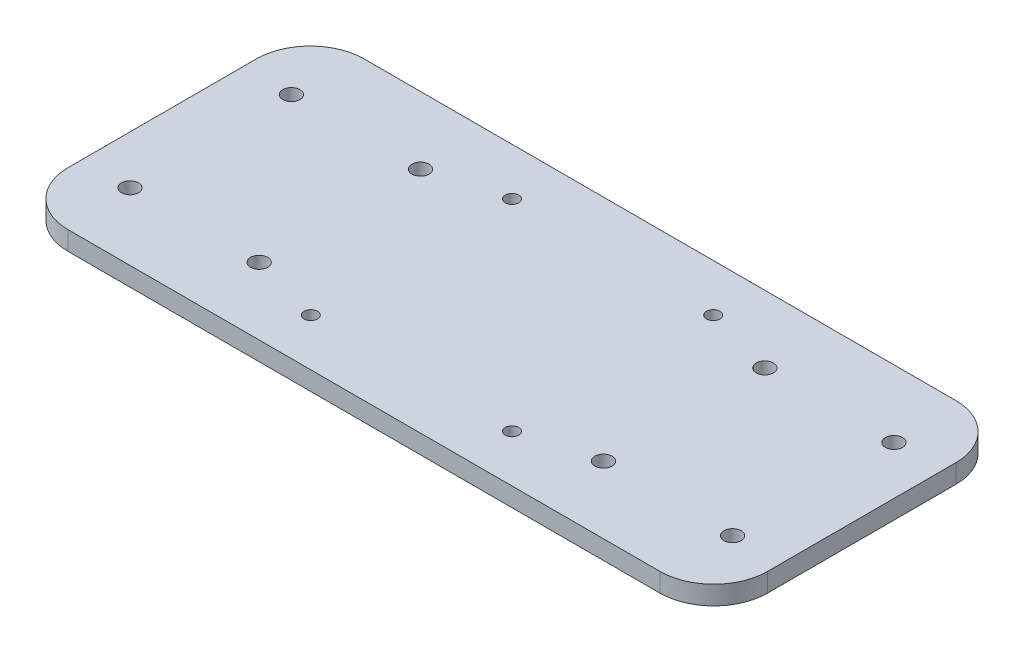
ISO-10303-21;
HEADER;
FILE_DESCRIPTION(('STEP AP214'),'2;1');
FILE_NAME('part.step','',(''),(''),'','','');
FILE_SCHEMA(('AUTOMOTIVE_DESIGN { 1 0 10303 214 1 1 1 1 }'));
ENDSEC;
DATA;
#1=APPLICATION_CONTEXT('core data for automotive mechanical design processes');
#2=APPLICATION_PROTOCOL_DEFINITION('international standard','automotive_design',2000,#1);
#3=PRODUCT_CONTEXT('',#1,'mechanical');
#4=PRODUCT('Part','Part','',(#3));
#5=PRODUCT_RELATED_PRODUCT_CATEGORY('part','',(#4));
#6=PRODUCT_DEFINITION_FORMATION('','',#4);
#7=PRODUCT_DEFINITION_CONTEXT('part definition',#1,'design');
#8=PRODUCT_DEFINITION('design','',#6,#7);
#9=PRODUCT_DEFINITION_SHAPE('','',#8);
#10=(LENGTH_UNIT() NAMED_UNIT(*) SI_UNIT(.MILLI.,.METRE.));
#11=(NAMED_UNIT(*) PLANE_ANGLE_UNIT() SI_UNIT($,.RADIAN.));
#12=(NAMED_UNIT(*) SI_UNIT($,.STERADIAN.) SOLID_ANGLE_UNIT());
#13=UNCERTAINTY_MEASURE_WITH_UNIT(LENGTH_MEASURE(1.E-05),#10,'distance_accuracy_value','');
#14=(GEOMETRIC_REPRESENTATION_CONTEXT(3) GLOBAL_UNCERTAINTY_ASSIGNED_CONTEXT((#13)) GLOBAL_UNIT_ASSIGNED_CONTEXT((#10,
#11,#12)) REPRESENTATION_CONTEXT('',''));
#15=CARTESIAN_POINT('',(0.,0.,0.));
#16=DIRECTION('',(0.,0.,1.));
#17=DIRECTION('',(1.,0.,0.));
#18=AXIS2_PLACEMENT_3D('',#15,#16,#17);
#19=CARTESIAN_POINT('',(0.,3.5,0.));
#20=DIRECTION('',(0.,1.,0.));
#21=DIRECTION('',(0.,0.,1.));
#22=AXIS2_PLACEMENT_3D('',#19,#20,#21);
#23=PLANE('',#22);
#24=CARTESIAN_POINT('',(46.3,3.5,46.2));
#25=DIRECTION('',(0.,1.,0.));
#26=DIRECTION('',(0.,0.,1.));
#27=AXIS2_PLACEMENT_3D('',#24,#25,#26);
#28=CIRCLE('',#27,1.25);
#29=CARTESIAN_POINT('',(46.3,3.5,47.45));
#30=VERTEX_POINT('',#29);
#31=EDGE_CURVE('E271',#30,#30,#28,.T.);
#32=ORIENTED_EDGE('',*,*,#31,.F.);
#33=EDGE_LOOP('',(#32));
#34=FACE_BOUND('',#33,.T.);
#35=CARTESIAN_POINT('',(83.7,3.5,8.8));
#36=DIRECTION('',(0.,1.,0.));
#37=DIRECTION('',(0.,0.,1.));
#38=AXIS2_PLACEMENT_3D('',#35,#36,#37);
#39=CIRCLE('',#38,1.25);
#40=CARTESIAN_POINT('',(83.7,3.5,10.05));
#41=VERTEX_POINT('',#40);
#42=EDGE_CURVE('E255',#41,#41,#39,.T.);
#43=ORIENTED_EDGE('',*,*,#42,.F.);
#44=EDGE_LOOP('',(#43));
#45=FACE_BOUND('',#44,.T.);
#46=CARTESIAN_POINT('',(97.,3.5,12.5));
#47=DIRECTION('',(0.,1.,0.));
#48=DIRECTION('',(0.,0.,-1.));
#49=AXIS2_PLACEMENT_3D('',#46,#47,#48);
#50=CIRCLE('',#49,1.6);
#51=CARTESIAN_POINT('',(97.,3.5,10.9));
#52=VERTEX_POINT('',#51);
#53=EDGE_CURVE('E239',#52,#52,#50,.T.);
#54=ORIENTED_EDGE('',*,*,#53,.F.);
#55=EDGE_LOOP('',(#54));
#56=FACE_BOUND('',#55,.T.);
#57=CARTESIAN_POINT('',(121.,3.5,42.5));
#58=DIRECTION('',(0.,1.,0.));
#59=DIRECTION('',(0.,0.,-1.));
#60=AXIS2_PLACEMENT_3D('',#57,#58,#59);
#61=CIRCLE('',#60,1.59999999999999);
#62=CARTESIAN_POINT('',(121.,3.5,40.9));
#63=VERTEX_POINT('',#62);
#64=EDGE_CURVE('E223',#63,#63,#61,.T.);
#65=ORIENTED_EDGE('',*,*,#64,.F.);
#66=EDGE_LOOP('',(#65));
#67=FACE_BOUND('',#66,.T.);
#68=CARTESIAN_POINT('',(33.,3.5,12.5));
#69=DIRECTION('',(0.,1.,0.));
#70=DIRECTION('',(0.,0.,1.));
#71=AXIS2_PLACEMENT_3D('',#68,#69,#70);
#72=CIRCLE('',#71,1.6);
#73=CARTESIAN_POINT('',(33.,3.5,14.1));
#74=VERTEX_POINT('',#73);
#75=EDGE_CURVE('E207',#74,#74,#72,.T.);
#76=ORIENTED_EDGE('',*,*,#75,.F.);
#77=EDGE_LOOP('',(#76));
#78=FACE_BOUND('',#77,.T.);
#79=CARTESIAN_POINT('',(9.,3.5,12.5));
#80=DIRECTION('',(0.,1.,0.));
#81=DIRECTION('',(0.,0.,1.));
#82=AXIS2_PLACEMENT_3D('',#79,#80,#81);
#83=CIRCLE('',#82,1.6);
#84=CARTESIAN_POINT('',(9.,3.5,14.1));
#85=VERTEX_POINT('',#84);
#86=EDGE_CURVE('E144',#85,#85,#83,.T.);
#87=ORIENTED_EDGE('',*,*,#86,.F.);
#88=EDGE_LOOP('',(#87));
#89=FACE_BOUND('',#88,.T.);
#90=DIRECTION('',(0.,0.,1.));
#91=VECTOR('',#90,1.);
#92=CARTESIAN_POINT('',(0.,3.5,0.));
#93=LINE('',#92,#91);
#94=CARTESIAN_POINT('',(0.,3.5,10.));
#95=VERTEX_POINT('',#94);
#96=CARTESIAN_POINT('',(0.,3.5,45.));
#97=VERTEX_POINT('',#96);
#98=EDGE_CURVE('E150',#95,#97,#93,.T.);
#99=ORIENTED_EDGE('',*,*,#98,.T.);
#100=CARTESIAN_POINT('',(10.,3.5,45.));
#101=DIRECTION('',(0.,1.,0.));
#102=DIRECTION('',(0.,0.,1.));
#103=AXIS2_PLACEMENT_3D('',#100,#101,#102);
#104=CIRCLE('',#103,10.);
#105=CARTESIAN_POINT('',(10.,3.5,55.));
#106=VERTEX_POINT('',#105);
#107=EDGE_CURVE('E174',#97,#106,#104,.T.);
#108=ORIENTED_EDGE('',*,*,#107,.T.);
#109=DIRECTION('',(1.,0.,0.));
#110=VECTOR('',#109,1.);
#111=CARTESIAN_POINT('',(0.,3.5,55.));
#112=LINE('',#111,#110);
#113=CARTESIAN_POINT('',(120.,3.5,55.));
#114=VERTEX_POINT('',#113);
#115=EDGE_CURVE('E127',#106,#114,#112,.T.);
#116=ORIENTED_EDGE('',*,*,#115,.T.);
#117=CARTESIAN_POINT('',(120.,3.5,45.));
#118=DIRECTION('',(0.,1.,0.));
#119=DIRECTION('',(0.,0.,1.));
#120=AXIS2_PLACEMENT_3D('',#117,#118,#119);
#121=CIRCLE('',#120,10.);
#122=CARTESIAN_POINT('',(130.,3.5,45.));
#123=VERTEX_POINT('',#122);
#124=EDGE_CURVE('E171',#114,#123,#121,.T.);
#125=ORIENTED_EDGE('',*,*,#124,.T.);
#126=DIRECTION('',(0.,0.,-1.));
#127=VECTOR('',#126,1.);
#128=CARTESIAN_POINT('',(130.,3.5,0.));
#129=LINE('',#128,#127);
#130=CARTESIAN_POINT('',(130.,3.5,10.));
#131=VERTEX_POINT('',#130);
#132=EDGE_CURVE('E186',#123,#131,#129,.T.);
#133=ORIENTED_EDGE('',*,*,#132,.T.);
#134=CARTESIAN_POINT('',(120.,3.5,10.));
#135=DIRECTION('',(0.,1.,0.));
#136=DIRECTION('',(0.,0.,1.));
#137=AXIS2_PLACEMENT_3D('',#134,#135,#136);
#138=CIRCLE('',#137,10.);
#139=CARTESIAN_POINT('',(120.,3.5,0.));
#140=VERTEX_POINT('',#139);
#141=EDGE_CURVE('E61',#131,#140,#138,.T.);
#142=ORIENTED_EDGE('',*,*,#141,.T.);
#143=DIRECTION('',(-1.,0.,0.));
#144=VECTOR('',#143,1.);
#145=CARTESIAN_POINT('',(0.,3.5,0.));
#146=LINE('',#145,#144);
#147=CARTESIAN_POINT('',(10.,3.5,0.));
#148=VERTEX_POINT('',#147);
#149=EDGE_CURVE('E152',#140,#148,#146,.T.);
#150=ORIENTED_EDGE('',*,*,#149,.T.);
#151=CARTESIAN_POINT('',(10.,3.5,10.));
#152=DIRECTION('',(0.,1.,0.));
#153=DIRECTION('',(0.,0.,1.));
#154=AXIS2_PLACEMENT_3D('',#151,#152,#153);
#155=CIRCLE('',#154,10.);
#156=EDGE_CURVE('E166',#148,#95,#155,.T.);
#157=ORIENTED_EDGE('',*,*,#156,.T.);
#158=EDGE_LOOP('',(#99,#108,#116,#125,#133,#142,#150,#157));
#159=FACE_BOUND('',#158,.T.);
#160=CARTESIAN_POINT('',(9.00000000000007,3.5,42.5));
#161=DIRECTION('',(0.,1.,0.));
#162=DIRECTION('',(0.,0.,1.));
#163=AXIS2_PLACEMENT_3D('',#160,#161,#162);
#164=CIRCLE('',#163,1.59999999999993);
#165=CARTESIAN_POINT('',(9.00000000000007,3.5,44.0999999999999));
#166=VERTEX_POINT('',#165);
#167=EDGE_CURVE('E199',#166,#166,#164,.T.);
#168=ORIENTED_EDGE('',*,*,#167,.F.);
#169=EDGE_LOOP('',(#168));
#170=FACE_BOUND('',#169,.T.);
#171=CARTESIAN_POINT('',(33.0000000000001,3.5,42.5));
#172=DIRECTION('',(0.,1.,0.));
#173=DIRECTION('',(0.,0.,1.));
#174=AXIS2_PLACEMENT_3D('',#171,#172,#173);
#175=CIRCLE('',#174,1.59999999999993);
#176=CARTESIAN_POINT('',(33.0000000000001,3.5,44.0999999999999));
#177=VERTEX_POINT('',#176);
#178=EDGE_CURVE('E215',#177,#177,#175,.T.);
#179=ORIENTED_EDGE('',*,*,#178,.F.);
#180=EDGE_LOOP('',(#179));
#181=FACE_BOUND('',#180,.T.);
#182=CARTESIAN_POINT('',(97.,3.5,42.5));
#183=DIRECTION('',(0.,1.,0.));
#184=DIRECTION('',(0.,0.,-1.));
#185=AXIS2_PLACEMENT_3D('',#182,#183,#184);
#186=CIRCLE('',#185,1.59999999999999);
#187=CARTESIAN_POINT('',(97.,3.5,40.9));
#188=VERTEX_POINT('',#187);
#189=EDGE_CURVE('E231',#188,#188,#186,.T.);
#190=ORIENTED_EDGE('',*,*,#189,.F.);
#191=EDGE_LOOP('',(#190));
#192=FACE_BOUND('',#191,.T.);
#193=CARTESIAN_POINT('',(121.,3.5,12.5));
#194=DIRECTION('',(0.,1.,0.));
#195=DIRECTION('',(0.,0.,-1.));
#196=AXIS2_PLACEMENT_3D('',#193,#194,#195);
#197=CIRCLE('',#196,1.59999999999999);
#198=CARTESIAN_POINT('',(121.,3.5,10.9));
#199=VERTEX_POINT('',#198);
#200=EDGE_CURVE('E247',#199,#199,#197,.T.);
#201=ORIENTED_EDGE('',*,*,#200,.F.);
#202=EDGE_LOOP('',(#201));
#203=FACE_BOUND('',#202,.T.);
#204=CARTESIAN_POINT('',(83.7,3.5,46.2));
#205=DIRECTION('',(0.,1.,0.));
#206=DIRECTION('',(0.,0.,1.));
#207=AXIS2_PLACEMENT_3D('',#204,#205,#206);
#208=CIRCLE('',#207,1.25);
#209=CARTESIAN_POINT('',(83.7,3.5,47.45));
#210=VERTEX_POINT('',#209);
#211=EDGE_CURVE('E263',#210,#210,#208,.T.);
#212=ORIENTED_EDGE('',*,*,#211,.F.);
#213=EDGE_LOOP('',(#212));
#214=FACE_BOUND('',#213,.T.);
#215=CARTESIAN_POINT('',(46.3,3.5,8.8));
#216=DIRECTION('',(0.,1.,0.));
#217=DIRECTION('',(0.,0.,1.));
#218=AXIS2_PLACEMENT_3D('',#215,#216,#217);
#219=CIRCLE('',#218,1.25);
#220=CARTESIAN_POINT('',(46.3,3.5,10.05));
#221=VERTEX_POINT('',#220);
#222=EDGE_CURVE('E279',#221,#221,#219,.T.);
#223=ORIENTED_EDGE('',*,*,#222,.F.);
#224=EDGE_LOOP('',(#223));
#225=FACE_BOUND('',#224,.T.);
#226=ADVANCED_FACE('F39',(#34,#45,#56,#67,#78,#89,#159,#170,#181,#192,#203,#214,#225),#23,.T.);
#227=CARTESIAN_POINT('',(0.,0.,0.));
#228=DIRECTION('',(0.,1.,0.));
#229=DIRECTION('',(0.,0.,1.));
#230=AXIS2_PLACEMENT_3D('',#227,#228,#229);
#231=PLANE('',#230);
#232=DIRECTION('',(1.,0.,0.));
#233=VECTOR('',#232,1.);
#234=CARTESIAN_POINT('',(0.,0.,55.));
#235=LINE('',#234,#233);
#236=CARTESIAN_POINT('',(10.,0.,55.));
#237=VERTEX_POINT('',#236);
#238=CARTESIAN_POINT('',(120.,0.,55.));
#239=VERTEX_POINT('',#238);
#240=EDGE_CURVE('E124',#237,#239,#235,.T.);
#241=ORIENTED_EDGE('',*,*,#240,.F.);
#242=CARTESIAN_POINT('',(10.,0.,45.));
#243=DIRECTION('',(0.,1.,0.));
#244=DIRECTION('',(0.,0.,1.));
#245=AXIS2_PLACEMENT_3D('',#242,#243,#244);
#246=CIRCLE('',#245,10.);
#247=CARTESIAN_POINT('',(0.,0.,45.));
#248=VERTEX_POINT('',#247);
#249=EDGE_CURVE('E106',#237,#248,#246,.F.);
#250=ORIENTED_EDGE('',*,*,#249,.T.);
#251=DIRECTION('',(0.,0.,1.));
#252=VECTOR('',#251,1.);
#253=CARTESIAN_POINT('',(0.,0.,0.));
#254=LINE('',#253,#252);
#255=CARTESIAN_POINT('',(0.,0.,10.));
#256=VERTEX_POINT('',#255);
#257=EDGE_CURVE('E137',#256,#248,#254,.T.);
#258=ORIENTED_EDGE('',*,*,#257,.F.);
#259=CARTESIAN_POINT('',(10.,0.,10.));
#260=DIRECTION('',(0.,1.,0.));
#261=DIRECTION('',(0.,0.,1.));
#262=AXIS2_PLACEMENT_3D('',#259,#260,#261);
#263=CIRCLE('',#262,10.);
#264=CARTESIAN_POINT('',(10.,0.,0.));
#265=VERTEX_POINT('',#264);
#266=EDGE_CURVE('E129',#256,#265,#263,.F.);
#267=ORIENTED_EDGE('',*,*,#266,.T.);
#268=DIRECTION('',(-1.,0.,0.));
#269=VECTOR('',#268,1.);
#270=CARTESIAN_POINT('',(0.,0.,0.));
#271=LINE('',#270,#269);
#272=CARTESIAN_POINT('',(120.,0.,0.));
#273=VERTEX_POINT('',#272);
#274=EDGE_CURVE('E142',#273,#265,#271,.T.);
#275=ORIENTED_EDGE('',*,*,#274,.F.);
#276=CARTESIAN_POINT('',(120.,0.,10.));
#277=DIRECTION('',(0.,1.,0.));
#278=DIRECTION('',(0.,0.,1.));
#279=AXIS2_PLACEMENT_3D('',#276,#277,#278);
#280=CIRCLE('',#279,10.);
#281=CARTESIAN_POINT('',(130.,0.,10.));
#282=VERTEX_POINT('',#281);
#283=EDGE_CURVE('E156',#273,#282,#280,.F.);
#284=ORIENTED_EDGE('',*,*,#283,.T.);
#285=DIRECTION('',(0.,0.,-1.));
#286=VECTOR('',#285,1.);
#287=CARTESIAN_POINT('',(130.,0.,0.));
#288=LINE('',#287,#286);
#289=CARTESIAN_POINT('',(130.,0.,45.));
#290=VERTEX_POINT('',#289);
#291=EDGE_CURVE('E136',#290,#282,#288,.T.);
#292=ORIENTED_EDGE('',*,*,#291,.F.);
#293=CARTESIAN_POINT('',(120.,0.,45.));
#294=DIRECTION('',(0.,1.,0.));
#295=DIRECTION('',(0.,0.,1.));
#296=AXIS2_PLACEMENT_3D('',#293,#294,#295);
#297=CIRCLE('',#296,10.);
#298=EDGE_CURVE('E118',#290,#239,#297,.F.);
#299=ORIENTED_EDGE('',*,*,#298,.T.);
#300=EDGE_LOOP('',(#241,#250,#258,#267,#275,#284,#292,#299));
#301=FACE_BOUND('',#300,.T.);
#302=CARTESIAN_POINT('',(9.,0.,12.5));
#303=DIRECTION('',(0.,1.,0.));
#304=DIRECTION('',(0.,0.,1.));
#305=AXIS2_PLACEMENT_3D('',#302,#303,#304);
#306=CIRCLE('',#305,1.6);
#307=CARTESIAN_POINT('',(9.,0.,14.1));
#308=VERTEX_POINT('',#307);
#309=EDGE_CURVE('E195',#308,#308,#306,.T.);
#310=ORIENTED_EDGE('',*,*,#309,.T.);
#311=EDGE_LOOP('',(#310));
#312=FACE_BOUND('',#311,.T.);
#313=CARTESIAN_POINT('',(9.00000000000007,0.,42.5));
#314=DIRECTION('',(0.,1.,0.));
#315=DIRECTION('',(0.,0.,1.));
#316=AXIS2_PLACEMENT_3D('',#313,#314,#315);
#317=CIRCLE('',#316,1.59999999999993);
#318=CARTESIAN_POINT('',(9.00000000000007,0.,44.0999999999999));
#319=VERTEX_POINT('',#318);
#320=EDGE_CURVE('E203',#319,#319,#317,.T.);
#321=ORIENTED_EDGE('',*,*,#320,.T.);
#322=EDGE_LOOP('',(#321));
#323=FACE_BOUND('',#322,.T.);
#324=CARTESIAN_POINT('',(33.,0.,12.5));
#325=DIRECTION('',(0.,1.,0.));
#326=DIRECTION('',(0.,0.,1.));
#327=AXIS2_PLACEMENT_3D('',#324,#325,#326);
#328=CIRCLE('',#327,1.6);
#329=CARTESIAN_POINT('',(33.,0.,14.1));
#330=VERTEX_POINT('',#329);
#331=EDGE_CURVE('E211',#330,#330,#328,.T.);
#332=ORIENTED_EDGE('',*,*,#331,.T.);
#333=EDGE_LOOP('',(#332));
#334=FACE_BOUND('',#333,.T.);
#335=CARTESIAN_POINT('',(33.0000000000001,0.,42.5));
#336=DIRECTION('',(0.,1.,0.));
#337=DIRECTION('',(0.,0.,1.));
#338=AXIS2_PLACEMENT_3D('',#335,#336,#337);
#339=CIRCLE('',#338,1.59999999999993);
#340=CARTESIAN_POINT('',(33.0000000000001,0.,44.0999999999999));
#341=VERTEX_POINT('',#340);
#342=EDGE_CURVE('E219',#341,#341,#339,.T.);
#343=ORIENTED_EDGE('',*,*,#342,.T.);
#344=EDGE_LOOP('',(#343));
#345=FACE_BOUND('',#344,.T.);
#346=CARTESIAN_POINT('',(121.,0.,42.5));
#347=DIRECTION('',(0.,1.,0.));
#348=DIRECTION('',(0.,0.,-1.));
#349=AXIS2_PLACEMENT_3D('',#346,#347,#348);
#350=CIRCLE('',#349,1.59999999999999);
#351=CARTESIAN_POINT('',(121.,0.,40.9));
#352=VERTEX_POINT('',#351);
#353=EDGE_CURVE('E227',#352,#352,#350,.T.);
#354=ORIENTED_EDGE('',*,*,#353,.T.);
#355=EDGE_LOOP('',(#354));
#356=FACE_BOUND('',#355,.T.);
#357=CARTESIAN_POINT('',(97.,0.,42.5));
#358=DIRECTION('',(0.,1.,0.));
#359=DIRECTION('',(0.,0.,-1.));
#360=AXIS2_PLACEMENT_3D('',#357,#358,#359);
#361=CIRCLE('',#360,1.59999999999999);
#362=CARTESIAN_POINT('',(97.,0.,40.9));
#363=VERTEX_POINT('',#362);
#364=EDGE_CURVE('E235',#363,#363,#361,.T.);
#365=ORIENTED_EDGE('',*,*,#364,.T.);
#366=EDGE_LOOP('',(#365));
#367=FACE_BOUND('',#366,.T.);
#368=CARTESIAN_POINT('',(97.,0.,12.5));
#369=DIRECTION('',(0.,1.,0.));
#370=DIRECTION('',(0.,0.,-1.));
#371=AXIS2_PLACEMENT_3D('',#368,#369,#370);
#372=CIRCLE('',#371,1.6);
#373=CARTESIAN_POINT('',(97.,0.,10.9));
#374=VERTEX_POINT('',#373);
#375=EDGE_CURVE('E243',#374,#374,#372,.T.);
#376=ORIENTED_EDGE('',*,*,#375,.T.);
#377=EDGE_LOOP('',(#376));
#378=FACE_BOUND('',#377,.T.);
#379=CARTESIAN_POINT('',(121.,0.,12.5));
#380=DIRECTION('',(0.,1.,0.));
#381=DIRECTION('',(0.,0.,-1.));
#382=AXIS2_PLACEMENT_3D('',#379,#380,#381);
#383=CIRCLE('',#382,1.59999999999999);
#384=CARTESIAN_POINT('',(121.,0.,10.9));
#385=VERTEX_POINT('',#384);
#386=EDGE_CURVE('E251',#385,#385,#383,.T.);
#387=ORIENTED_EDGE('',*,*,#386,.T.);
#388=EDGE_LOOP('',(#387));
#389=FACE_BOUND('',#388,.T.);
#390=CARTESIAN_POINT('',(83.7,0.,8.8));
#391=DIRECTION('',(0.,1.,0.));
#392=DIRECTION('',(0.,0.,1.));
#393=AXIS2_PLACEMENT_3D('',#390,#391,#392);
#394=CIRCLE('',#393,1.25);
#395=CARTESIAN_POINT('',(83.7,0.,10.05));
#396=VERTEX_POINT('',#395);
#397=EDGE_CURVE('E259',#396,#396,#394,.T.);
#398=ORIENTED_EDGE('',*,*,#397,.T.);
#399=EDGE_LOOP('',(#398));
#400=FACE_BOUND('',#399,.T.);
#401=CARTESIAN_POINT('',(83.7,0.,46.2));
#402=DIRECTION('',(0.,1.,0.));
#403=DIRECTION('',(0.,0.,1.));
#404=AXIS2_PLACEMENT_3D('',#401,#402,#403);
#405=CIRCLE('',#404,1.25);
#406=CARTESIAN_POINT('',(83.7,0.,47.45));
#407=VERTEX_POINT('',#406);
#408=EDGE_CURVE('E267',#407,#407,#405,.T.);
#409=ORIENTED_EDGE('',*,*,#408,.T.);
#410=EDGE_LOOP('',(#409));
#411=FACE_BOUND('',#410,.T.);
#412=CARTESIAN_POINT('',(46.3,0.,46.2));
#413=DIRECTION('',(0.,1.,0.));
#414=DIRECTION('',(0.,0.,1.));
#415=AXIS2_PLACEMENT_3D('',#412,#413,#414);
#416=CIRCLE('',#415,1.25);
#417=CARTESIAN_POINT('',(46.3,0.,47.45));
#418=VERTEX_POINT('',#417);
#419=EDGE_CURVE('E275',#418,#418,#416,.T.);
#420=ORIENTED_EDGE('',*,*,#419,.T.);
#421=EDGE_LOOP('',(#420));
#422=FACE_BOUND('',#421,.T.);
#423=CARTESIAN_POINT('',(46.3,0.,8.8));
#424=DIRECTION('',(0.,1.,0.));
#425=DIRECTION('',(0.,0.,1.));
#426=AXIS2_PLACEMENT_3D('',#423,#424,#425);
#427=CIRCLE('',#426,1.25);
#428=CARTESIAN_POINT('',(46.3,0.,10.05));
#429=VERTEX_POINT('',#428);
#430=EDGE_CURVE('E283',#429,#429,#427,.T.);
#431=ORIENTED_EDGE('',*,*,#430,.T.);
#432=EDGE_LOOP('',(#431));
#433=FACE_BOUND('',#432,.T.);
#434=ADVANCED_FACE('F132',(#301,#312,#323,#334,#345,#356,#367,#378,#389,#400,#411,#422,#433),
#231,.F.);
#435=CARTESIAN_POINT('',(0.,3.5,0.));
#436=DIRECTION('',(1.,0.,0.));
#437=DIRECTION('',(0.,0.,-1.));
#438=AXIS2_PLACEMENT_3D('',#435,#436,#437);
#439=PLANE('',#438);
#440=ORIENTED_EDGE('',*,*,#257,.T.);
#441=DIRECTION('',(0.,-1.,0.));
#442=VECTOR('',#441,1.);
#443=CARTESIAN_POINT('',(0.,3.5,45.));
#444=LINE('',#443,#442);
#445=EDGE_CURVE('E111',#248,#97,#444,.F.);
#446=ORIENTED_EDGE('',*,*,#445,.T.);
#447=ORIENTED_EDGE('',*,*,#98,.F.);
#448=DIRECTION('',(0.,-1.,0.));
#449=VECTOR('',#448,1.);
#450=CARTESIAN_POINT('',(0.,3.5,10.));
#451=LINE('',#450,#449);
#452=EDGE_CURVE('E117',#95,#256,#451,.T.);
#453=ORIENTED_EDGE('',*,*,#452,.T.);
#454=EDGE_LOOP('',(#440,#446,#447,#453));
#455=FACE_BOUND('',#454,.T.);
#456=ADVANCED_FACE('F300',(#455),#439,.F.);
#457=CARTESIAN_POINT('',(0.,3.5,55.));
#458=DIRECTION('',(0.,0.,-1.));
#459=DIRECTION('',(-1.,0.,0.));
#460=AXIS2_PLACEMENT_3D('',#457,#458,#459);
#461=PLANE('',#460);
#462=ORIENTED_EDGE('',*,*,#115,.F.);
#463=DIRECTION('',(0.,-1.,0.));
#464=VECTOR('',#463,1.);
#465=CARTESIAN_POINT('',(10.,3.5,55.));
#466=LINE('',#465,#464);
#467=EDGE_CURVE('E110',#106,#237,#466,.T.);
#468=ORIENTED_EDGE('',*,*,#467,.T.);
#469=ORIENTED_EDGE('',*,*,#240,.T.);
#470=DIRECTION('',(0.,-1.,0.));
#471=VECTOR('',#470,1.);
#472=CARTESIAN_POINT('',(120.,3.5,55.));
#473=LINE('',#472,#471);
#474=EDGE_CURVE('E130',#239,#114,#473,.F.);
#475=ORIENTED_EDGE('',*,*,#474,.T.);
#476=EDGE_LOOP('',(#462,#468,#469,#475));
#477=FACE_BOUND('',#476,.T.);
#478=ADVANCED_FACE('F123',(#477),#461,.F.);
#479=CARTESIAN_POINT('',(130.,3.5,0.));
#480=DIRECTION('',(-1.,0.,0.));
#481=DIRECTION('',(0.,0.,1.));
#482=AXIS2_PLACEMENT_3D('',#479,#480,#481);
#483=PLANE('',#482);
#484=ORIENTED_EDGE('',*,*,#132,.F.);
#485=DIRECTION('',(0.,-1.,0.));
#486=VECTOR('',#485,1.);
#487=CARTESIAN_POINT('',(130.,3.5,45.));
#488=LINE('',#487,#486);
#489=EDGE_CURVE('E180',#123,#290,#488,.T.);
#490=ORIENTED_EDGE('',*,*,#489,.T.);
#491=ORIENTED_EDGE('',*,*,#291,.T.);
#492=DIRECTION('',(0.,-1.,0.));
#493=VECTOR('',#492,1.);
#494=CARTESIAN_POINT('',(130.,3.5,10.));
#495=LINE('',#494,#493);
#496=EDGE_CURVE('E177',#282,#131,#495,.F.);
#497=ORIENTED_EDGE('',*,*,#496,.T.);
#498=EDGE_LOOP('',(#484,#490,#491,#497));
#499=FACE_BOUND('',#498,.T.);
#500=ADVANCED_FACE('F311',(#499),#483,.F.);
#501=CARTESIAN_POINT('',(0.,3.5,0.));
#502=DIRECTION('',(0.,0.,1.));
#503=DIRECTION('',(1.,0.,0.));
#504=AXIS2_PLACEMENT_3D('',#501,#502,#503);
#505=PLANE('',#504);
#506=ORIENTED_EDGE('',*,*,#149,.F.);
#507=DIRECTION('',(0.,-1.,0.));
#508=VECTOR('',#507,1.);
#509=CARTESIAN_POINT('',(120.,3.5,0.));
#510=LINE('',#509,#508);
#511=EDGE_CURVE('E11',#140,#273,#510,.T.);
#512=ORIENTED_EDGE('',*,*,#511,.T.);
#513=ORIENTED_EDGE('',*,*,#274,.T.);
#514=DIRECTION('',(0.,-1.,0.));
#515=VECTOR('',#514,1.);
#516=CARTESIAN_POINT('',(10.,3.5,0.));
#517=LINE('',#516,#515);
#518=EDGE_CURVE('E48',#265,#148,#517,.F.);
#519=ORIENTED_EDGE('',*,*,#518,.T.);
#520=EDGE_LOOP('',(#506,#512,#513,#519));
#521=FACE_BOUND('',#520,.T.);
#522=ADVANCED_FACE('F308',(#521),#505,.F.);
#523=CARTESIAN_POINT('',(9.,3.5,12.5));
#524=DIRECTION('',(0.,-1.,0.));
#525=DIRECTION('',(0.,0.,-1.));
#526=AXIS2_PLACEMENT_3D('',#523,#524,#525);
#527=CYLINDRICAL_SURFACE('',#526,1.6);
#528=ORIENTED_EDGE('',*,*,#86,.T.);
#529=EDGE_LOOP('',(#528));
#530=FACE_BOUND('',#529,.T.);
#531=ORIENTED_EDGE('',*,*,#309,.F.);
#532=EDGE_LOOP('',(#531));
#533=FACE_BOUND('',#532,.T.);
#534=ADVANCED_FACE('F305',(#530,#533),#527,.F.);
#535=CARTESIAN_POINT('',(9.00000000000007,3.5,42.5));
#536=DIRECTION('',(0.,-1.,0.));
#537=DIRECTION('',(0.,0.,-1.));
#538=AXIS2_PLACEMENT_3D('',#535,#536,#537);
#539=CYLINDRICAL_SURFACE('',#538,1.59999999999993);
#540=ORIENTED_EDGE('',*,*,#167,.T.);
#541=EDGE_LOOP('',(#540));
#542=FACE_BOUND('',#541,.T.);
#543=ORIENTED_EDGE('',*,*,#320,.F.);
#544=EDGE_LOOP('',(#543));
#545=FACE_BOUND('',#544,.T.);
#546=ADVANCED_FACE('F393',(#542,#545),#539,.F.);
#547=CARTESIAN_POINT('',(33.,3.5,12.5));
#548=DIRECTION('',(0.,-1.,0.));
#549=DIRECTION('',(0.,0.,-1.));
#550=AXIS2_PLACEMENT_3D('',#547,#548,#549);
#551=CYLINDRICAL_SURFACE('',#550,1.6);
#552=ORIENTED_EDGE('',*,*,#75,.T.);
#553=EDGE_LOOP('',(#552));
#554=FACE_BOUND('',#553,.T.);
#555=ORIENTED_EDGE('',*,*,#331,.F.);
#556=EDGE_LOOP('',(#555));
#557=FACE_BOUND('',#556,.T.);
#558=ADVANCED_FACE('F390',(#554,#557),#551,.F.);
#559=CARTESIAN_POINT('',(33.0000000000001,3.5,42.5));
#560=DIRECTION('',(0.,-1.,0.));
#561=DIRECTION('',(0.,0.,-1.));
#562=AXIS2_PLACEMENT_3D('',#559,#560,#561);
#563=CYLINDRICAL_SURFACE('',#562,1.59999999999993);
#564=ORIENTED_EDGE('',*,*,#178,.T.);
#565=EDGE_LOOP('',(#564));
#566=FACE_BOUND('',#565,.T.);
#567=ORIENTED_EDGE('',*,*,#342,.F.);
#568=EDGE_LOOP('',(#567));
#569=FACE_BOUND('',#568,.T.);
#570=ADVANCED_FACE('F386',(#566,#569),#563,.F.);
#571=CARTESIAN_POINT('',(121.,3.5,42.5));
#572=DIRECTION('',(0.,-1.,0.));
#573=DIRECTION('',(0.,0.,-1.));
#574=AXIS2_PLACEMENT_3D('',#571,#572,#573);
#575=CYLINDRICAL_SURFACE('',#574,1.59999999999999);
#576=ORIENTED_EDGE('',*,*,#64,.T.);
#577=EDGE_LOOP('',(#576));
#578=FACE_BOUND('',#577,.T.);
#579=ORIENTED_EDGE('',*,*,#353,.F.);
#580=EDGE_LOOP('',(#579));
#581=FACE_BOUND('',#580,.T.);
#582=ADVANCED_FACE('F382',(#578,#581),#575,.F.);
#583=CARTESIAN_POINT('',(97.,3.5,42.5));
#584=DIRECTION('',(0.,-1.,0.));
#585=DIRECTION('',(0.,0.,-1.));
#586=AXIS2_PLACEMENT_3D('',#583,#584,#585);
#587=CYLINDRICAL_SURFACE('',#586,1.59999999999999);
#588=ORIENTED_EDGE('',*,*,#189,.T.);
#589=EDGE_LOOP('',(#588));
#590=FACE_BOUND('',#589,.T.);
#591=ORIENTED_EDGE('',*,*,#364,.F.);
#592=EDGE_LOOP('',(#591));
#593=FACE_BOUND('',#592,.T.);
#594=ADVANCED_FACE('F378',(#590,#593),#587,.F.);
#595=CARTESIAN_POINT('',(97.,3.5,12.5));
#596=DIRECTION('',(0.,-1.,0.));
#597=DIRECTION('',(0.,0.,-1.));
#598=AXIS2_PLACEMENT_3D('',#595,#596,#597);
#599=CYLINDRICAL_SURFACE('',#598,1.6);
#600=ORIENTED_EDGE('',*,*,#53,.T.);
#601=EDGE_LOOP('',(#600));
#602=FACE_BOUND('',#601,.T.);
#603=ORIENTED_EDGE('',*,*,#375,.F.);
#604=EDGE_LOOP('',(#603));
#605=FACE_BOUND('',#604,.T.);
#606=ADVANCED_FACE('F374',(#602,#605),#599,.F.);
#607=CARTESIAN_POINT('',(121.,3.5,12.5));
#608=DIRECTION('',(0.,-1.,0.));
#609=DIRECTION('',(0.,0.,-1.));
#610=AXIS2_PLACEMENT_3D('',#607,#608,#609);
#611=CYLINDRICAL_SURFACE('',#610,1.59999999999999);
#612=ORIENTED_EDGE('',*,*,#200,.T.);
#613=EDGE_LOOP('',(#612));
#614=FACE_BOUND('',#613,.T.);
#615=ORIENTED_EDGE('',*,*,#386,.F.);
#616=EDGE_LOOP('',(#615));
#617=FACE_BOUND('',#616,.T.);
#618=ADVANCED_FACE('F370',(#614,#617),#611,.F.);
#619=CARTESIAN_POINT('',(83.7,3.5,8.8));
#620=DIRECTION('',(0.,-1.,0.));
#621=DIRECTION('',(0.,0.,-1.));
#622=AXIS2_PLACEMENT_3D('',#619,#620,#621);
#623=CYLINDRICAL_SURFACE('',#622,1.25);
#624=ORIENTED_EDGE('',*,*,#42,.T.);
#625=EDGE_LOOP('',(#624));
#626=FACE_BOUND('',#625,.T.);
#627=ORIENTED_EDGE('',*,*,#397,.F.);
#628=EDGE_LOOP('',(#627));
#629=FACE_BOUND('',#628,.T.);
#630=ADVANCED_FACE('F352',(#626,#629),#623,.F.);
#631=CARTESIAN_POINT('',(83.7,3.5,46.2));
#632=DIRECTION('',(0.,-1.,0.));
#633=DIRECTION('',(0.,0.,-1.));
#634=AXIS2_PLACEMENT_3D('',#631,#632,#633);
#635=CYLINDRICAL_SURFACE('',#634,1.25);
#636=ORIENTED_EDGE('',*,*,#211,.T.);
#637=EDGE_LOOP('',(#636));
#638=FACE_BOUND('',#637,.T.);
#639=ORIENTED_EDGE('',*,*,#408,.F.);
#640=EDGE_LOOP('',(#639));
#641=FACE_BOUND('',#640,.T.);
#642=ADVANCED_FACE('F348',(#638,#641),#635,.F.);
#643=CARTESIAN_POINT('',(46.3,3.5,46.2));
#644=DIRECTION('',(0.,-1.,0.));
#645=DIRECTION('',(0.,0.,-1.));
#646=AXIS2_PLACEMENT_3D('',#643,#644,#645);
#647=CYLINDRICAL_SURFACE('',#646,1.25);
#648=ORIENTED_EDGE('',*,*,#31,.T.);
#649=EDGE_LOOP('',(#648));
#650=FACE_BOUND('',#649,.T.);
#651=ORIENTED_EDGE('',*,*,#419,.F.);
#652=EDGE_LOOP('',(#651));
#653=FACE_BOUND('',#652,.T.);
#654=ADVANCED_FACE('F351',(#650,#653),#647,.F.);
#655=CARTESIAN_POINT('',(46.3,3.5,8.8));
#656=DIRECTION('',(0.,-1.,0.));
#657=DIRECTION('',(0.,0.,-1.));
#658=AXIS2_PLACEMENT_3D('',#655,#656,#657);
#659=CYLINDRICAL_SURFACE('',#658,1.25);
#660=ORIENTED_EDGE('',*,*,#222,.T.);
#661=EDGE_LOOP('',(#660));
#662=FACE_BOUND('',#661,.T.);
#663=ORIENTED_EDGE('',*,*,#430,.F.);
#664=EDGE_LOOP('',(#663));
#665=FACE_BOUND('',#664,.T.);
#666=ADVANCED_FACE('F291',(#662,#665),#659,.F.);
#667=CARTESIAN_POINT('',(10.,3.5,45.));
#668=DIRECTION('',(0.,-1.,0.));
#669=DIRECTION('',(0.,0.,-1.));
#670=AXIS2_PLACEMENT_3D('',#667,#668,#669);
#671=CYLINDRICAL_SURFACE('',#670,10.);
#672=ORIENTED_EDGE('',*,*,#107,.F.);
#673=ORIENTED_EDGE('',*,*,#445,.F.);
#674=ORIENTED_EDGE('',*,*,#249,.F.);
#675=ORIENTED_EDGE('',*,*,#467,.F.);
#676=EDGE_LOOP('',(#672,#673,#674,#675));
#677=FACE_BOUND('',#676,.T.);
#678=ADVANCED_FACE('F109',(#677),#671,.T.);
#679=CARTESIAN_POINT('',(120.,3.5,45.));
#680=DIRECTION('',(0.,-1.,0.));
#681=DIRECTION('',(0.,0.,-1.));
#682=AXIS2_PLACEMENT_3D('',#679,#680,#681);
#683=CYLINDRICAL_SURFACE('',#682,10.);
#684=ORIENTED_EDGE('',*,*,#124,.F.);
#685=ORIENTED_EDGE('',*,*,#474,.F.);
#686=ORIENTED_EDGE('',*,*,#298,.F.);
#687=ORIENTED_EDGE('',*,*,#489,.F.);
#688=EDGE_LOOP('',(#684,#685,#686,#687));
#689=FACE_BOUND('',#688,.T.);
#690=ADVANCED_FACE('F322',(#689),#683,.T.);
#691=CARTESIAN_POINT('',(120.,3.5,10.));
#692=DIRECTION('',(0.,-1.,0.));
#693=DIRECTION('',(0.,0.,-1.));
#694=AXIS2_PLACEMENT_3D('',#691,#692,#693);
#695=CYLINDRICAL_SURFACE('',#694,10.);
#696=ORIENTED_EDGE('',*,*,#141,.F.);
#697=ORIENTED_EDGE('',*,*,#496,.F.);
#698=ORIENTED_EDGE('',*,*,#283,.F.);
#699=ORIENTED_EDGE('',*,*,#511,.F.);
#700=EDGE_LOOP('',(#696,#697,#698,#699));
#701=FACE_BOUND('',#700,.T.);
#702=ADVANCED_FACE('F324',(#701),#695,.T.);
#703=CARTESIAN_POINT('',(10.,3.5,10.));
#704=DIRECTION('',(0.,-1.,0.));
#705=DIRECTION('',(0.,0.,-1.));
#706=AXIS2_PLACEMENT_3D('',#703,#704,#705);
#707=CYLINDRICAL_SURFACE('',#706,10.);
#708=ORIENTED_EDGE('',*,*,#156,.F.);
#709=ORIENTED_EDGE('',*,*,#518,.F.);
#710=ORIENTED_EDGE('',*,*,#266,.F.);
#711=ORIENTED_EDGE('',*,*,#452,.F.);
#712=EDGE_LOOP('',(#708,#709,#710,#711));
#713=FACE_BOUND('',#712,.T.);
#714=ADVANCED_FACE('F41',(#713),#707,.T.);
#715=CLOSED_SHELL('',(#226,#434,#456,#478,#500,#522,#534,#546,#558,#570,#582,#594,#606,#618,
#630,#642,#654,#666,#678,#690,#702,#714));
#716=MANIFOLD_SOLID_BREP('B2',#715);
#717=ADVANCED_BREP_SHAPE_REPRESENTATION('',(#18,#716),#14);
#718=SHAPE_DEFINITION_REPRESENTATION(#9,#717);
ENDSEC;
END-ISO-10303-21;
